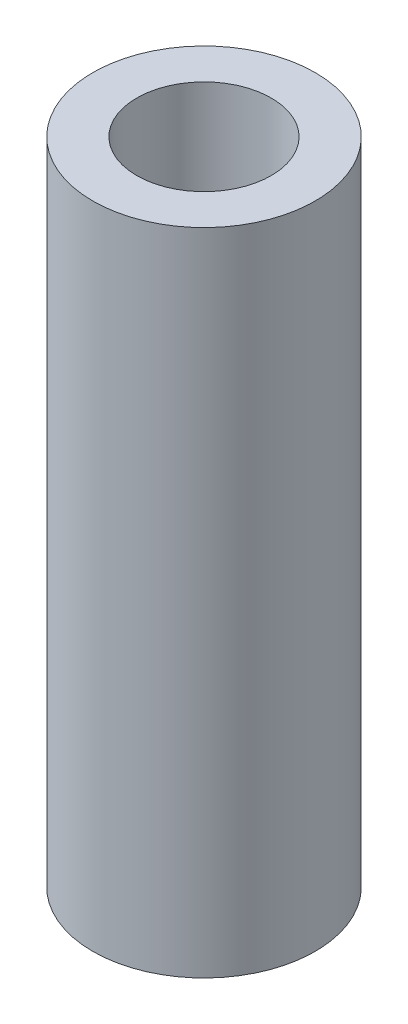
ISO-10303-21;
HEADER;
FILE_DESCRIPTION(('STEP AP214'),'2;1');
FILE_NAME('part.step','',(''),(''),'','','');
FILE_SCHEMA(('AUTOMOTIVE_DESIGN { 1 0 10303 214 1 1 1 1 }'));
ENDSEC;
DATA;
#1=APPLICATION_CONTEXT('core data for automotive mechanical design processes');
#2=APPLICATION_PROTOCOL_DEFINITION('international standard','automotive_design',2000,#1);
#3=PRODUCT_CONTEXT('',#1,'mechanical');
#4=PRODUCT('Part','Part','',(#3));
#5=PRODUCT_RELATED_PRODUCT_CATEGORY('part','',(#4));
#6=PRODUCT_DEFINITION_FORMATION('','',#4);
#7=PRODUCT_DEFINITION_CONTEXT('part definition',#1,'design');
#8=PRODUCT_DEFINITION('design','',#6,#7);
#9=PRODUCT_DEFINITION_SHAPE('','',#8);
#10=(LENGTH_UNIT() NAMED_UNIT(*) SI_UNIT(.MILLI.,.METRE.));
#11=(NAMED_UNIT(*) PLANE_ANGLE_UNIT() SI_UNIT($,.RADIAN.));
#12=(NAMED_UNIT(*) SI_UNIT($,.STERADIAN.) SOLID_ANGLE_UNIT());
#13=UNCERTAINTY_MEASURE_WITH_UNIT(LENGTH_MEASURE(1.E-05),#10,'distance_accuracy_value','');
#14=(GEOMETRIC_REPRESENTATION_CONTEXT(3) GLOBAL_UNCERTAINTY_ASSIGNED_CONTEXT((#13)) GLOBAL_UNIT_ASSIGNED_CONTEXT((#10,
#11,#12)) REPRESENTATION_CONTEXT('',''));
#15=CARTESIAN_POINT('',(0.,0.,0.));
#16=DIRECTION('',(0.,0.,1.));
#17=DIRECTION('',(1.,0.,0.));
#18=AXIS2_PLACEMENT_3D('',#15,#16,#17);
#19=CARTESIAN_POINT('',(0.,43.8227666148208,0.));
#20=DIRECTION('',(0.,-1.,0.));
#21=DIRECTION('',(0.,0.,-1.));
#22=AXIS2_PLACEMENT_3D('',#19,#20,#21);
#23=CYLINDRICAL_SURFACE('',#22,7.5);
#24=CARTESIAN_POINT('',(0.,43.8227666148208,0.));
#25=DIRECTION('',(0.,1.,0.));
#26=DIRECTION('',(0.,0.,1.));
#27=AXIS2_PLACEMENT_3D('',#24,#25,#26);
#28=CIRCLE('',#27,7.5);
#29=CARTESIAN_POINT('',(0.,43.8227666148208,7.5));
#30=VERTEX_POINT('',#29);
#31=EDGE_CURVE('E10',#30,#30,#28,.T.);
#32=ORIENTED_EDGE('',*,*,#31,.F.);
#33=EDGE_LOOP('',(#32));
#34=FACE_BOUND('',#33,.T.);
#35=CARTESIAN_POINT('',(0.,0.,0.));
#36=DIRECTION('',(0.,1.,0.));
#37=DIRECTION('',(0.,0.,1.));
#38=AXIS2_PLACEMENT_3D('',#35,#36,#37);
#39=CIRCLE('',#38,7.5);
#40=CARTESIAN_POINT('',(0.,0.,7.5));
#41=VERTEX_POINT('',#40);
#42=EDGE_CURVE('E37',#41,#41,#39,.T.);
#43=ORIENTED_EDGE('',*,*,#42,.T.);
#44=EDGE_LOOP('',(#43));
#45=FACE_BOUND('',#44,.T.);
#46=ADVANCED_FACE('F40',(#34,#45),#23,.T.);
#47=CARTESIAN_POINT('',(0.,43.8227666148208,0.));
#48=DIRECTION('',(0.,1.,0.));
#49=DIRECTION('',(0.,0.,1.));
#50=AXIS2_PLACEMENT_3D('',#47,#48,#49);
#51=PLANE('',#50);
#52=CARTESIAN_POINT('',(0.,43.8227666148208,0.));
#53=DIRECTION('',(0.,1.,0.));
#54=DIRECTION('',(0.,0.,1.));
#55=AXIS2_PLACEMENT_3D('',#52,#53,#54);
#56=CIRCLE('',#55,4.53529013217874);
#57=CARTESIAN_POINT('',(0.,43.8227666148208,4.53529013217874));
#58=VERTEX_POINT('',#57);
#59=EDGE_CURVE('E50',#58,#58,#56,.T.);
#60=ORIENTED_EDGE('',*,*,#59,.F.);
#61=EDGE_LOOP('',(#60));
#62=FACE_BOUND('',#61,.T.);
#63=ORIENTED_EDGE('',*,*,#31,.T.);
#64=EDGE_LOOP('',(#63));
#65=FACE_BOUND('',#64,.T.);
#66=ADVANCED_FACE('F59',(#62,#65),#51,.T.);
#67=CARTESIAN_POINT('',(0.,0.,0.));
#68=DIRECTION('',(0.,1.,0.));
#69=DIRECTION('',(0.,0.,1.));
#70=AXIS2_PLACEMENT_3D('',#67,#68,#69);
#71=PLANE('',#70);
#72=CARTESIAN_POINT('',(0.,0.,0.));
#73=DIRECTION('',(0.,1.,0.));
#74=DIRECTION('',(0.,0.,1.));
#75=AXIS2_PLACEMENT_3D('',#72,#73,#74);
#76=CIRCLE('',#75,4.53529013217874);
#77=CARTESIAN_POINT('',(0.,0.,4.53529013217874));
#78=VERTEX_POINT('',#77);
#79=EDGE_CURVE('E47',#78,#78,#76,.T.);
#80=ORIENTED_EDGE('',*,*,#79,.T.);
#81=EDGE_LOOP('',(#80));
#82=FACE_BOUND('',#81,.T.);
#83=ORIENTED_EDGE('',*,*,#42,.F.);
#84=EDGE_LOOP('',(#83));
#85=FACE_BOUND('',#84,.T.);
#86=ADVANCED_FACE('F58',(#82,#85),#71,.F.);
#87=CARTESIAN_POINT('',(0.,43.8227666148208,0.));
#88=DIRECTION('',(0.,-1.,0.));
#89=DIRECTION('',(0.,0.,-1.));
#90=AXIS2_PLACEMENT_3D('',#87,#88,#89);
#91=CYLINDRICAL_SURFACE('',#90,4.53529013217874);
#92=ORIENTED_EDGE('',*,*,#59,.T.);
#93=EDGE_LOOP('',(#92));
#94=FACE_BOUND('',#93,.T.);
#95=ORIENTED_EDGE('',*,*,#79,.F.);
#96=EDGE_LOOP('',(#95));
#97=FACE_BOUND('',#96,.T.);
#98=ADVANCED_FACE('F54',(#94,#97),#91,.F.);
#99=CLOSED_SHELL('',(#46,#66,#86,#98));
#100=MANIFOLD_SOLID_BREP('B2',#99);
#101=ADVANCED_BREP_SHAPE_REPRESENTATION('',(#18,#100),#14);
#102=SHAPE_DEFINITION_REPRESENTATION(#9,#101);
ENDSEC;
END-ISO-10303-21;
